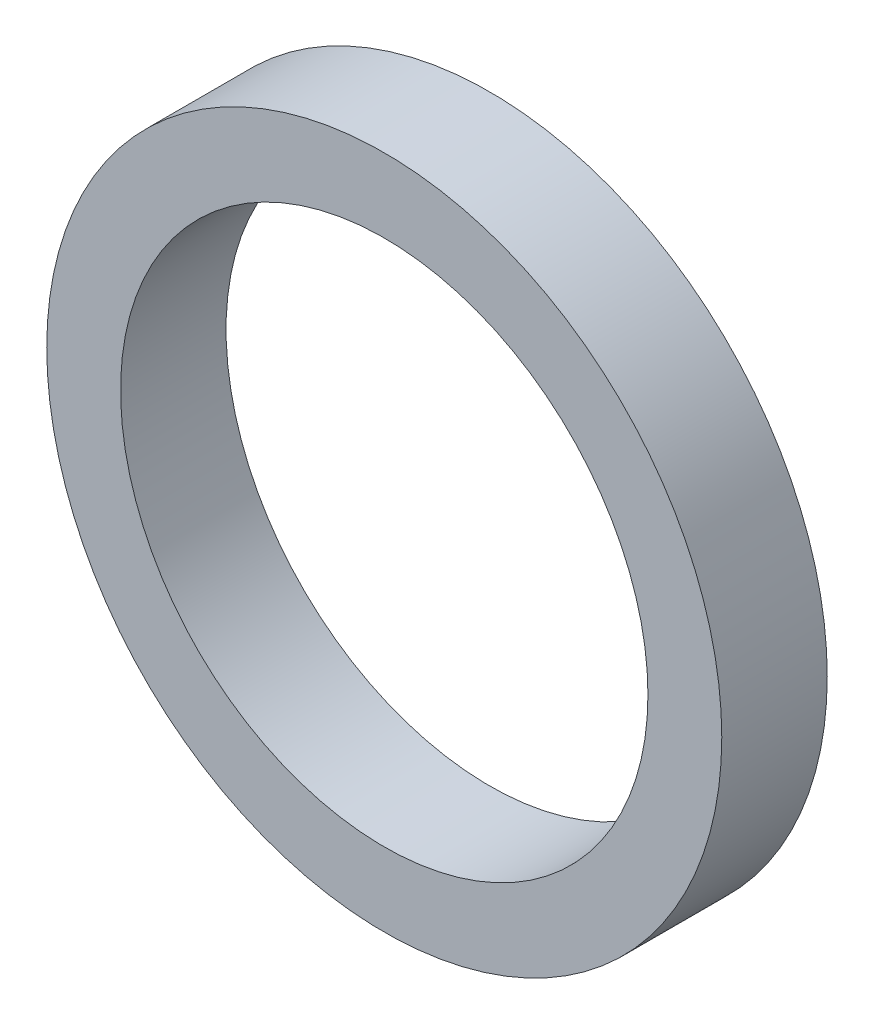
ISO-10303-21;
HEADER;
FILE_DESCRIPTION(('STEP AP214'),'2;1');
FILE_NAME('part.step','',(''),(''),'','','');
FILE_SCHEMA(('AUTOMOTIVE_DESIGN { 1 0 10303 214 1 1 1 1 }'));
ENDSEC;
DATA;
#1=APPLICATION_CONTEXT('core data for automotive mechanical design processes');
#2=APPLICATION_PROTOCOL_DEFINITION('international standard','automotive_design',2000,#1);
#3=PRODUCT_CONTEXT('',#1,'mechanical');
#4=PRODUCT('Part','Part','',(#3));
#5=PRODUCT_RELATED_PRODUCT_CATEGORY('part','',(#4));
#6=PRODUCT_DEFINITION_FORMATION('','',#4);
#7=PRODUCT_DEFINITION_CONTEXT('part definition',#1,'design');
#8=PRODUCT_DEFINITION('design','',#6,#7);
#9=PRODUCT_DEFINITION_SHAPE('','',#8);
#10=(LENGTH_UNIT() NAMED_UNIT(*) SI_UNIT(.MILLI.,.METRE.));
#11=(NAMED_UNIT(*) PLANE_ANGLE_UNIT() SI_UNIT($,.RADIAN.));
#12=(NAMED_UNIT(*) SI_UNIT($,.STERADIAN.) SOLID_ANGLE_UNIT());
#13=UNCERTAINTY_MEASURE_WITH_UNIT(LENGTH_MEASURE(1.E-05),#10,'distance_accuracy_value','');
#14=(GEOMETRIC_REPRESENTATION_CONTEXT(3) GLOBAL_UNCERTAINTY_ASSIGNED_CONTEXT((#13)) GLOBAL_UNIT_ASSIGNED_CONTEXT((#10,
#11,#12)) REPRESENTATION_CONTEXT('',''));
#15=CARTESIAN_POINT('',(0.,0.,0.));
#16=DIRECTION('',(0.,0.,1.));
#17=DIRECTION('',(1.,0.,0.));
#18=AXIS2_PLACEMENT_3D('',#15,#16,#17);
#19=CARTESIAN_POINT('',(0.,0.,5.));
#20=DIRECTION('',(0.,0.,1.));
#21=DIRECTION('',(1.,0.,0.));
#22=AXIS2_PLACEMENT_3D('',#19,#20,#21);
#23=PLANE('',#22);
#24=CARTESIAN_POINT('',(0.,0.,5.));
#25=DIRECTION('',(0.,0.,1.));
#26=DIRECTION('',(1.,0.,0.));
#27=AXIS2_PLACEMENT_3D('',#24,#25,#26);
#28=CIRCLE('',#27,32.);
#29=CARTESIAN_POINT('',(32.,0.,5.));
#30=VERTEX_POINT('',#29);
#31=EDGE_CURVE('E10',#30,#30,#28,.T.);
#32=ORIENTED_EDGE('',*,*,#31,.T.);
#33=EDGE_LOOP('',(#32));
#34=FACE_BOUND('',#33,.T.);
#35=CARTESIAN_POINT('',(0.,0.,5.));
#36=DIRECTION('',(0.,0.,1.));
#37=DIRECTION('',(1.,0.,0.));
#38=AXIS2_PLACEMENT_3D('',#35,#36,#37);
#39=CIRCLE('',#38,25.);
#40=CARTESIAN_POINT('',(25.,0.,5.));
#41=VERTEX_POINT('',#40);
#42=EDGE_CURVE('E42',#41,#41,#39,.T.);
#43=ORIENTED_EDGE('',*,*,#42,.F.);
#44=EDGE_LOOP('',(#43));
#45=FACE_BOUND('',#44,.T.);
#46=ADVANCED_FACE('F31',(#34,#45),#23,.T.);
#47=CARTESIAN_POINT('',(0.,0.,-5.));
#48=DIRECTION('',(0.,0.,1.));
#49=DIRECTION('',(1.,0.,0.));
#50=AXIS2_PLACEMENT_3D('',#47,#48,#49);
#51=PLANE('',#50);
#52=CARTESIAN_POINT('',(0.,0.,-5.));
#53=DIRECTION('',(0.,0.,1.));
#54=DIRECTION('',(1.,0.,0.));
#55=AXIS2_PLACEMENT_3D('',#52,#53,#54);
#56=CIRCLE('',#55,32.);
#57=CARTESIAN_POINT('',(32.,0.,-5.));
#58=VERTEX_POINT('',#57);
#59=EDGE_CURVE('E35',#58,#58,#56,.T.);
#60=ORIENTED_EDGE('',*,*,#59,.F.);
#61=EDGE_LOOP('',(#60));
#62=FACE_BOUND('',#61,.T.);
#63=CARTESIAN_POINT('',(0.,0.,-5.));
#64=DIRECTION('',(0.,0.,1.));
#65=DIRECTION('',(1.,0.,0.));
#66=AXIS2_PLACEMENT_3D('',#63,#64,#65);
#67=CIRCLE('',#66,25.);
#68=CARTESIAN_POINT('',(25.,0.,-5.));
#69=VERTEX_POINT('',#68);
#70=EDGE_CURVE('E44',#69,#69,#67,.T.);
#71=ORIENTED_EDGE('',*,*,#70,.T.);
#72=EDGE_LOOP('',(#71));
#73=FACE_BOUND('',#72,.T.);
#74=ADVANCED_FACE('F54',(#62,#73),#51,.F.);
#75=CARTESIAN_POINT('',(0.,0.,5.));
#76=DIRECTION('',(0.,0.,-1.));
#77=DIRECTION('',(-1.,0.,0.));
#78=AXIS2_PLACEMENT_3D('',#75,#76,#77);
#79=CYLINDRICAL_SURFACE('',#78,32.);
#80=ORIENTED_EDGE('',*,*,#31,.F.);
#81=EDGE_LOOP('',(#80));
#82=FACE_BOUND('',#81,.T.);
#83=ORIENTED_EDGE('',*,*,#59,.T.);
#84=EDGE_LOOP('',(#83));
#85=FACE_BOUND('',#84,.T.);
#86=ADVANCED_FACE('F33',(#82,#85),#79,.T.);
#87=CARTESIAN_POINT('',(0.,0.,5.));
#88=DIRECTION('',(0.,0.,-1.));
#89=DIRECTION('',(-1.,0.,0.));
#90=AXIS2_PLACEMENT_3D('',#87,#88,#89);
#91=CYLINDRICAL_SURFACE('',#90,25.);
#92=ORIENTED_EDGE('',*,*,#42,.T.);
#93=EDGE_LOOP('',(#92));
#94=FACE_BOUND('',#93,.T.);
#95=ORIENTED_EDGE('',*,*,#70,.F.);
#96=EDGE_LOOP('',(#95));
#97=FACE_BOUND('',#96,.T.);
#98=ADVANCED_FACE('F50',(#94,#97),#91,.F.);
#99=CLOSED_SHELL('',(#46,#74,#86,#98));
#100=MANIFOLD_SOLID_BREP('B2',#99);
#101=ADVANCED_BREP_SHAPE_REPRESENTATION('',(#18,#100),#14);
#102=SHAPE_DEFINITION_REPRESENTATION(#9,#101);
ENDSEC;
END-ISO-10303-21;
